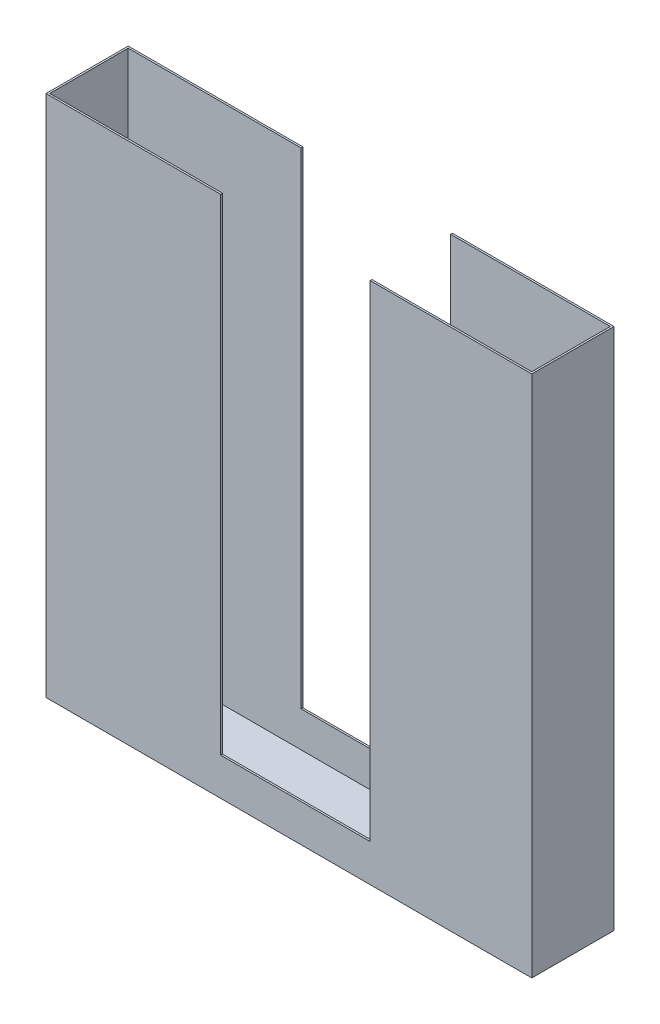
ISO-10303-21;
HEADER;
FILE_DESCRIPTION(('STEP AP214'),'2;1');
FILE_NAME('part.step','',(''),(''),'','','');
FILE_SCHEMA(('AUTOMOTIVE_DESIGN { 1 0 10303 214 1 1 1 1 }'));
ENDSEC;
DATA;
#1=APPLICATION_CONTEXT('core data for automotive mechanical design processes');
#2=APPLICATION_PROTOCOL_DEFINITION('international standard','automotive_design',2000,#1);
#3=PRODUCT_CONTEXT('',#1,'mechanical');
#4=PRODUCT('Part','Part','',(#3));
#5=PRODUCT_RELATED_PRODUCT_CATEGORY('part','',(#4));
#6=PRODUCT_DEFINITION_FORMATION('','',#4);
#7=PRODUCT_DEFINITION_CONTEXT('part definition',#1,'design');
#8=PRODUCT_DEFINITION('design','',#6,#7);
#9=PRODUCT_DEFINITION_SHAPE('','',#8);
#10=(LENGTH_UNIT() NAMED_UNIT(*) SI_UNIT(.MILLI.,.METRE.));
#11=(NAMED_UNIT(*) PLANE_ANGLE_UNIT() SI_UNIT($,.RADIAN.));
#12=(NAMED_UNIT(*) SI_UNIT($,.STERADIAN.) SOLID_ANGLE_UNIT());
#13=UNCERTAINTY_MEASURE_WITH_UNIT(LENGTH_MEASURE(1.E-05),#10,'distance_accuracy_value','');
#14=(GEOMETRIC_REPRESENTATION_CONTEXT(3) GLOBAL_UNCERTAINTY_ASSIGNED_CONTEXT((#13)) GLOBAL_UNIT_ASSIGNED_CONTEXT((#10,
#11,#12)) REPRESENTATION_CONTEXT('',''));
#15=CARTESIAN_POINT('',(0.,0.,0.));
#16=DIRECTION('',(0.,0.,1.));
#17=DIRECTION('',(1.,0.,0.));
#18=AXIS2_PLACEMENT_3D('',#15,#16,#17);
#19=CARTESIAN_POINT('',(-118.55585106383,36.2253989361702,69.85));
#20=DIRECTION('',(0.,1.,0.));
#21=DIRECTION('',(0.,0.,1.));
#22=AXIS2_PLACEMENT_3D('',#19,#20,#21);
#23=PLANE('',#22);
#24=DIRECTION('',(0.,0.,1.));
#25=VECTOR('',#24,1.);
#26=CARTESIAN_POINT('',(29.9023693860386,36.2253989361702,69.85));
#27=LINE('',#26,#25);
#28=CARTESIAN_POINT('',(29.9023693860386,36.2253989361702,0.));
#29=VERTEX_POINT('',#28);
#30=CARTESIAN_POINT('',(29.9023693860386,36.2253989361702,1.5875));
#31=VERTEX_POINT('',#30);
#32=EDGE_CURVE('E185',#29,#31,#27,.T.);
#33=ORIENTED_EDGE('',*,*,#32,.F.);
#34=DIRECTION('',(1.,0.,0.));
#35=VECTOR('',#34,1.);
#36=CARTESIAN_POINT('',(-118.55585106383,36.2253989361702,0.));
#37=LINE('',#36,#35);
#38=CARTESIAN_POINT('',(-118.55585106383,36.2253989361702,0.));
#39=VERTEX_POINT('',#38);
#40=EDGE_CURVE('E165',#39,#29,#37,.T.);
#41=ORIENTED_EDGE('',*,*,#40,.F.);
#42=DIRECTION('',(0.,0.,-1.));
#43=VECTOR('',#42,1.);
#44=CARTESIAN_POINT('',(-118.55585106383,36.2253989361702,69.85));
#45=LINE('',#44,#43);
#46=CARTESIAN_POINT('',(-118.55585106383,36.2253989361702,69.85));
#47=VERTEX_POINT('',#46);
#48=EDGE_CURVE('E240',#47,#39,#45,.T.);
#49=ORIENTED_EDGE('',*,*,#48,.F.);
#50=DIRECTION('',(1.,0.,0.));
#51=VECTOR('',#50,1.);
#52=CARTESIAN_POINT('',(-118.55585106383,36.2253989361702,69.85));
#53=LINE('',#52,#51);
#54=CARTESIAN_POINT('',(29.9023693860386,36.2253989361702,69.85));
#55=VERTEX_POINT('',#54);
#56=EDGE_CURVE('E237',#47,#55,#53,.T.);
#57=ORIENTED_EDGE('',*,*,#56,.T.);
#58=CARTESIAN_POINT('',(29.9023693860386,36.2253989361702,68.2625));
#59=VERTEX_POINT('',#58);
#60=EDGE_CURVE('E188',#59,#55,#27,.T.);
#61=ORIENTED_EDGE('',*,*,#60,.F.);
#62=DIRECTION('',(1.,0.,0.));
#63=VECTOR('',#62,1.);
#64=CARTESIAN_POINT('',(-118.55585106383,36.2253989361702,68.2625));
#65=LINE('',#64,#63);
#66=CARTESIAN_POINT('',(-116.96835106383,36.2253989361702,68.2625));
#67=VERTEX_POINT('',#66);
#68=EDGE_CURVE('E221',#67,#59,#65,.T.);
#69=ORIENTED_EDGE('',*,*,#68,.F.);
#70=DIRECTION('',(0.,0.,-1.));
#71=VECTOR('',#70,1.);
#72=CARTESIAN_POINT('',(-116.96835106383,36.2253989361702,69.85));
#73=LINE('',#72,#71);
#74=CARTESIAN_POINT('',(-116.96835106383,36.2253989361702,1.5875));
#75=VERTEX_POINT('',#74);
#76=EDGE_CURVE('E218',#67,#75,#73,.T.);
#77=ORIENTED_EDGE('',*,*,#76,.T.);
#78=DIRECTION('',(1.,0.,0.));
#79=VECTOR('',#78,1.);
#80=CARTESIAN_POINT('',(-118.55585106383,36.2253989361702,1.58750000000001));
#81=LINE('',#80,#79);
#82=EDGE_CURVE('E204',#75,#31,#81,.T.);
#83=ORIENTED_EDGE('',*,*,#82,.T.);
#84=EDGE_LOOP('',(#33,#41,#49,#57,#61,#69,#77,#83));
#85=FACE_BOUND('',#84,.T.);
#86=ADVANCED_FACE('F33',(#85),#23,.T.);
#87=DIRECTION('',(0.,0.,-1.));
#88=VECTOR('',#87,1.);
#89=CARTESIAN_POINT('',(156.902369386039,36.2253989361702,69.85));
#90=LINE('',#89,#88);
#91=CARTESIAN_POINT('',(156.902369386039,36.2253989361702,69.85));
#92=VERTEX_POINT('',#91);
#93=CARTESIAN_POINT('',(156.902369386039,36.2253989361702,68.2625));
#94=VERTEX_POINT('',#93);
#95=EDGE_CURVE('E182',#92,#94,#90,.T.);
#96=ORIENTED_EDGE('',*,*,#95,.F.);
#97=CARTESIAN_POINT('',(294.19414893617,36.2253989361702,69.85));
#98=VERTEX_POINT('',#97);
#99=EDGE_CURVE('E236',#92,#98,#53,.T.);
#100=ORIENTED_EDGE('',*,*,#99,.T.);
#101=DIRECTION('',(0.,0.,-1.));
#102=VECTOR('',#101,1.);
#103=CARTESIAN_POINT('',(294.19414893617,36.2253989361702,69.85));
#104=LINE('',#103,#102);
#105=CARTESIAN_POINT('',(294.19414893617,36.2253989361702,0.));
#106=VERTEX_POINT('',#105);
#107=EDGE_CURVE('E252',#98,#106,#104,.T.);
#108=ORIENTED_EDGE('',*,*,#107,.T.);
#109=CARTESIAN_POINT('',(156.902369386039,36.2253989361702,0.));
#110=VERTEX_POINT('',#109);
#111=EDGE_CURVE('E249',#110,#106,#37,.T.);
#112=ORIENTED_EDGE('',*,*,#111,.F.);
#113=CARTESIAN_POINT('',(156.902369386039,36.2253989361702,1.5875));
#114=VERTEX_POINT('',#113);
#115=EDGE_CURVE('E179',#114,#110,#90,.T.);
#116=ORIENTED_EDGE('',*,*,#115,.F.);
#117=CARTESIAN_POINT('',(292.60664893617,36.2253989361702,1.5875));
#118=VERTEX_POINT('',#117);
#119=EDGE_CURVE('E214',#114,#118,#81,.T.);
#120=ORIENTED_EDGE('',*,*,#119,.T.);
#121=DIRECTION('',(0.,0.,-1.));
#122=VECTOR('',#121,1.);
#123=CARTESIAN_POINT('',(292.60664893617,36.2253989361702,69.85));
#124=LINE('',#123,#122);
#125=CARTESIAN_POINT('',(292.60664893617,36.2253989361702,68.2625));
#126=VERTEX_POINT('',#125);
#127=EDGE_CURVE('E209',#126,#118,#124,.T.);
#128=ORIENTED_EDGE('',*,*,#127,.F.);
#129=EDGE_CURVE('E217',#94,#126,#65,.T.);
#130=ORIENTED_EDGE('',*,*,#129,.F.);
#131=EDGE_LOOP('',(#96,#100,#108,#112,#116,#120,#128,#130));
#132=FACE_BOUND('',#131,.T.);
#133=ADVANCED_FACE('F270',(#132),#23,.T.);
#134=CARTESIAN_POINT('',(-118.55585106383,36.2253989361702,69.85));
#135=DIRECTION('',(1.,0.,0.));
#136=DIRECTION('',(0.,1.,0.));
#137=AXIS2_PLACEMENT_3D('',#134,#135,#136);
#138=PLANE('',#137);
#139=DIRECTION('',(0.,-1.,0.));
#140=VECTOR('',#139,1.);
#141=CARTESIAN_POINT('',(-118.55585106383,36.2253989361702,0.));
#142=LINE('',#141,#140);
#143=CARTESIAN_POINT('',(-118.55585106383,-408.27460106383,0.));
#144=VERTEX_POINT('',#143);
#145=EDGE_CURVE('E198',#39,#144,#142,.T.);
#146=ORIENTED_EDGE('',*,*,#145,.T.);
#147=DIRECTION('',(0.,0.,-1.));
#148=VECTOR('',#147,1.);
#149=CARTESIAN_POINT('',(-118.55585106383,-408.27460106383,69.85));
#150=LINE('',#149,#148);
#151=CARTESIAN_POINT('',(-118.55585106383,-408.27460106383,69.85));
#152=VERTEX_POINT('',#151);
#153=EDGE_CURVE('E257',#152,#144,#150,.T.);
#154=ORIENTED_EDGE('',*,*,#153,.F.);
#155=DIRECTION('',(0.,-1.,0.));
#156=VECTOR('',#155,1.);
#157=CARTESIAN_POINT('',(-118.55585106383,36.2253989361702,69.85));
#158=LINE('',#157,#156);
#159=EDGE_CURVE('E228',#47,#152,#158,.T.);
#160=ORIENTED_EDGE('',*,*,#159,.F.);
#161=ORIENTED_EDGE('',*,*,#48,.T.);
#162=EDGE_LOOP('',(#146,#154,#160,#161));
#163=FACE_BOUND('',#162,.T.);
#164=ADVANCED_FACE('F35',(#163),#138,.F.);
#165=CARTESIAN_POINT('',(-118.55585106383,-408.27460106383,69.85));
#166=DIRECTION('',(0.,1.,0.));
#167=DIRECTION('',(0.,0.,1.));
#168=AXIS2_PLACEMENT_3D('',#165,#166,#167);
#169=PLANE('',#168);
#170=DIRECTION('',(1.,0.,0.));
#171=VECTOR('',#170,1.);
#172=CARTESIAN_POINT('',(-118.55585106383,-408.27460106383,0.));
#173=LINE('',#172,#171);
#174=CARTESIAN_POINT('',(294.19414893617,-408.27460106383,0.));
#175=VERTEX_POINT('',#174);
#176=EDGE_CURVE('E243',#144,#175,#173,.T.);
#177=ORIENTED_EDGE('',*,*,#176,.T.);
#178=DIRECTION('',(0.,0.,-1.));
#179=VECTOR('',#178,1.);
#180=CARTESIAN_POINT('',(294.19414893617,-408.27460106383,69.85));
#181=LINE('',#180,#179);
#182=CARTESIAN_POINT('',(294.19414893617,-408.27460106383,69.85));
#183=VERTEX_POINT('',#182);
#184=EDGE_CURVE('E255',#183,#175,#181,.T.);
#185=ORIENTED_EDGE('',*,*,#184,.F.);
#186=DIRECTION('',(1.,0.,0.));
#187=VECTOR('',#186,1.);
#188=CARTESIAN_POINT('',(-118.55585106383,-408.27460106383,69.85));
#189=LINE('',#188,#187);
#190=EDGE_CURVE('E231',#152,#183,#189,.T.);
#191=ORIENTED_EDGE('',*,*,#190,.F.);
#192=ORIENTED_EDGE('',*,*,#153,.T.);
#193=EDGE_LOOP('',(#177,#185,#191,#192));
#194=FACE_BOUND('',#193,.T.);
#195=ADVANCED_FACE('F297',(#194),#169,.F.);
#196=CARTESIAN_POINT('',(294.19414893617,36.2253989361702,69.85));
#197=DIRECTION('',(1.,0.,0.));
#198=DIRECTION('',(0.,1.,0.));
#199=AXIS2_PLACEMENT_3D('',#196,#197,#198);
#200=PLANE('',#199);
#201=DIRECTION('',(0.,-1.,0.));
#202=VECTOR('',#201,1.);
#203=CARTESIAN_POINT('',(294.19414893617,36.2253989361702,0.));
#204=LINE('',#203,#202);
#205=EDGE_CURVE('E246',#106,#175,#204,.T.);
#206=ORIENTED_EDGE('',*,*,#205,.F.);
#207=ORIENTED_EDGE('',*,*,#107,.F.);
#208=DIRECTION('',(0.,-1.,0.));
#209=VECTOR('',#208,1.);
#210=CARTESIAN_POINT('',(294.19414893617,36.2253989361702,69.85));
#211=LINE('',#210,#209);
#212=EDGE_CURVE('E233',#98,#183,#211,.T.);
#213=ORIENTED_EDGE('',*,*,#212,.T.);
#214=ORIENTED_EDGE('',*,*,#184,.T.);
#215=EDGE_LOOP('',(#206,#207,#213,#214));
#216=FACE_BOUND('',#215,.T.);
#217=ADVANCED_FACE('F293',(#216),#200,.T.);
#218=CARTESIAN_POINT('',(0.,0.,69.85));
#219=DIRECTION('',(0.,0.,1.));
#220=DIRECTION('',(1.,0.,0.));
#221=AXIS2_PLACEMENT_3D('',#218,#219,#220);
#222=PLANE('',#221);
#223=DIRECTION('',(0.,-1.,0.));
#224=VECTOR('',#223,1.);
#225=CARTESIAN_POINT('',(29.9023693860386,36.2498882057866,69.85));
#226=LINE('',#225,#224);
#227=CARTESIAN_POINT('',(29.9023693860387,-376.500111794213,69.85));
#228=VERTEX_POINT('',#227);
#229=EDGE_CURVE('E172',#55,#228,#226,.T.);
#230=ORIENTED_EDGE('',*,*,#229,.F.);
#231=ORIENTED_EDGE('',*,*,#56,.F.);
#232=ORIENTED_EDGE('',*,*,#159,.T.);
#233=ORIENTED_EDGE('',*,*,#190,.T.);
#234=ORIENTED_EDGE('',*,*,#212,.F.);
#235=ORIENTED_EDGE('',*,*,#99,.F.);
#236=DIRECTION('',(0.,1.,0.));
#237=VECTOR('',#236,1.);
#238=CARTESIAN_POINT('',(156.902369386039,36.2498882057866,69.85));
#239=LINE('',#238,#237);
#240=CARTESIAN_POINT('',(156.902369386039,-376.500111794213,69.85));
#241=VERTEX_POINT('',#240);
#242=EDGE_CURVE('E166',#241,#92,#239,.T.);
#243=ORIENTED_EDGE('',*,*,#242,.F.);
#244=DIRECTION('',(1.,0.,0.));
#245=VECTOR('',#244,1.);
#246=CARTESIAN_POINT('',(29.9023693860387,-376.500111794213,69.85));
#247=LINE('',#246,#245);
#248=EDGE_CURVE('E168',#228,#241,#247,.T.);
#249=ORIENTED_EDGE('',*,*,#248,.F.);
#250=EDGE_LOOP('',(#230,#231,#232,#233,#234,#235,#243,#249));
#251=FACE_BOUND('',#250,.T.);
#252=ADVANCED_FACE('F288',(#251),#222,.T.);
#253=CARTESIAN_POINT('',(0.,0.,0.));
#254=DIRECTION('',(0.,0.,1.));
#255=DIRECTION('',(1.,0.,0.));
#256=AXIS2_PLACEMENT_3D('',#253,#254,#255);
#257=PLANE('',#256);
#258=ORIENTED_EDGE('',*,*,#40,.T.);
#259=DIRECTION('',(0.,-1.,0.));
#260=VECTOR('',#259,1.);
#261=CARTESIAN_POINT('',(29.9023693860386,36.2498882057866,0.));
#262=LINE('',#261,#260);
#263=CARTESIAN_POINT('',(29.9023693860387,-376.500111794213,0.));
#264=VERTEX_POINT('',#263);
#265=EDGE_CURVE('E145',#29,#264,#262,.T.);
#266=ORIENTED_EDGE('',*,*,#265,.T.);
#267=DIRECTION('',(1.,0.,0.));
#268=VECTOR('',#267,1.);
#269=CARTESIAN_POINT('',(29.9023693860387,-376.500111794213,0.));
#270=LINE('',#269,#268);
#271=CARTESIAN_POINT('',(156.902369386039,-376.500111794213,0.));
#272=VERTEX_POINT('',#271);
#273=EDGE_CURVE('E152',#264,#272,#270,.T.);
#274=ORIENTED_EDGE('',*,*,#273,.T.);
#275=DIRECTION('',(0.,1.,0.));
#276=VECTOR('',#275,1.);
#277=CARTESIAN_POINT('',(156.902369386039,36.2498882057866,0.));
#278=LINE('',#277,#276);
#279=EDGE_CURVE('E159',#272,#110,#278,.T.);
#280=ORIENTED_EDGE('',*,*,#279,.T.);
#281=ORIENTED_EDGE('',*,*,#111,.T.);
#282=ORIENTED_EDGE('',*,*,#205,.T.);
#283=ORIENTED_EDGE('',*,*,#176,.F.);
#284=ORIENTED_EDGE('',*,*,#145,.F.);
#285=EDGE_LOOP('',(#258,#266,#274,#280,#281,#282,#283,#284));
#286=FACE_BOUND('',#285,.T.);
#287=ADVANCED_FACE('F162',(#286),#257,.F.);
#288=CARTESIAN_POINT('',(-116.96835106383,36.2253989361702,69.85));
#289=DIRECTION('',(1.,0.,0.));
#290=DIRECTION('',(0.,1.,0.));
#291=AXIS2_PLACEMENT_3D('',#288,#289,#290);
#292=PLANE('',#291);
#293=DIRECTION('',(0.,-1.,0.));
#294=VECTOR('',#293,1.);
#295=CARTESIAN_POINT('',(-116.96835106383,36.2253989361702,1.58750000000001));
#296=LINE('',#295,#294);
#297=CARTESIAN_POINT('',(-116.96835106383,-406.68710106383,1.5875));
#298=VERTEX_POINT('',#297);
#299=EDGE_CURVE('E191',#75,#298,#296,.T.);
#300=ORIENTED_EDGE('',*,*,#299,.F.);
#301=ORIENTED_EDGE('',*,*,#76,.F.);
#302=DIRECTION('',(0.,-1.,0.));
#303=VECTOR('',#302,1.);
#304=CARTESIAN_POINT('',(-116.96835106383,36.2253989361702,68.2625));
#305=LINE('',#304,#303);
#306=CARTESIAN_POINT('',(-116.96835106383,-406.68710106383,68.2625));
#307=VERTEX_POINT('',#306);
#308=EDGE_CURVE('E200',#67,#307,#305,.T.);
#309=ORIENTED_EDGE('',*,*,#308,.T.);
#310=DIRECTION('',(0.,0.,-1.));
#311=VECTOR('',#310,1.);
#312=CARTESIAN_POINT('',(-116.96835106383,-406.68710106383,69.85));
#313=LINE('',#312,#311);
#314=EDGE_CURVE('E195',#307,#298,#313,.T.);
#315=ORIENTED_EDGE('',*,*,#314,.T.);
#316=EDGE_LOOP('',(#300,#301,#309,#315));
#317=FACE_BOUND('',#316,.T.);
#318=ADVANCED_FACE('F307',(#317),#292,.T.);
#319=CARTESIAN_POINT('',(-118.55585106383,-406.68710106383,69.85));
#320=DIRECTION('',(0.,1.,0.));
#321=DIRECTION('',(0.,0.,1.));
#322=AXIS2_PLACEMENT_3D('',#319,#320,#321);
#323=PLANE('',#322);
#324=DIRECTION('',(1.,0.,0.));
#325=VECTOR('',#324,1.);
#326=CARTESIAN_POINT('',(-118.55585106383,-406.68710106383,1.58750000000001));
#327=LINE('',#326,#325);
#328=CARTESIAN_POINT('',(292.60664893617,-406.68710106383,1.5875));
#329=VERTEX_POINT('',#328);
#330=EDGE_CURVE('E194',#298,#329,#327,.T.);
#331=ORIENTED_EDGE('',*,*,#330,.F.);
#332=ORIENTED_EDGE('',*,*,#314,.F.);
#333=DIRECTION('',(1.,0.,0.));
#334=VECTOR('',#333,1.);
#335=CARTESIAN_POINT('',(-118.55585106383,-406.68710106383,68.2625));
#336=LINE('',#335,#334);
#337=CARTESIAN_POINT('',(292.60664893617,-406.68710106383,68.2625));
#338=VERTEX_POINT('',#337);
#339=EDGE_CURVE('E203',#307,#338,#336,.T.);
#340=ORIENTED_EDGE('',*,*,#339,.T.);
#341=DIRECTION('',(0.,0.,-1.));
#342=VECTOR('',#341,1.);
#343=CARTESIAN_POINT('',(292.60664893617,-406.68710106383,69.85));
#344=LINE('',#343,#342);
#345=EDGE_CURVE('E199',#338,#329,#344,.T.);
#346=ORIENTED_EDGE('',*,*,#345,.T.);
#347=EDGE_LOOP('',(#331,#332,#340,#346));
#348=FACE_BOUND('',#347,.T.);
#349=ADVANCED_FACE('F310',(#348),#323,.T.);
#350=CARTESIAN_POINT('',(292.60664893617,36.2253989361702,69.85));
#351=DIRECTION('',(1.,0.,0.));
#352=DIRECTION('',(0.,1.,0.));
#353=AXIS2_PLACEMENT_3D('',#350,#351,#352);
#354=PLANE('',#353);
#355=DIRECTION('',(0.,-1.,0.));
#356=VECTOR('',#355,1.);
#357=CARTESIAN_POINT('',(292.60664893617,36.2253989361702,1.58750000000001));
#358=LINE('',#357,#356);
#359=EDGE_CURVE('E207',#118,#329,#358,.T.);
#360=ORIENTED_EDGE('',*,*,#359,.T.);
#361=ORIENTED_EDGE('',*,*,#345,.F.);
#362=DIRECTION('',(0.,-1.,0.));
#363=VECTOR('',#362,1.);
#364=CARTESIAN_POINT('',(292.60664893617,36.2253989361702,68.2625));
#365=LINE('',#364,#363);
#366=EDGE_CURVE('E211',#126,#338,#365,.T.);
#367=ORIENTED_EDGE('',*,*,#366,.F.);
#368=ORIENTED_EDGE('',*,*,#127,.T.);
#369=EDGE_LOOP('',(#360,#361,#367,#368));
#370=FACE_BOUND('',#369,.T.);
#371=ADVANCED_FACE('F276',(#370),#354,.F.);
#372=CARTESIAN_POINT('',(0.,0.,68.2625));
#373=DIRECTION('',(0.,0.,1.));
#374=DIRECTION('',(1.,0.,0.));
#375=AXIS2_PLACEMENT_3D('',#372,#373,#374);
#376=PLANE('',#375);
#377=ORIENTED_EDGE('',*,*,#68,.T.);
#378=DIRECTION('',(0.,-1.,0.));
#379=VECTOR('',#378,1.);
#380=CARTESIAN_POINT('',(29.9023693860386,0.,68.2625));
#381=LINE('',#380,#379);
#382=CARTESIAN_POINT('',(29.9023693860387,-376.500111794213,68.2625));
#383=VERTEX_POINT('',#382);
#384=EDGE_CURVE('E187',#59,#383,#381,.T.);
#385=ORIENTED_EDGE('',*,*,#384,.T.);
#386=DIRECTION('',(1.,0.,0.));
#387=VECTOR('',#386,1.);
#388=CARTESIAN_POINT('',(-1.64566572003103E-13,-376.500111794213,68.2625));
#389=LINE('',#388,#387);
#390=CARTESIAN_POINT('',(156.902369386039,-376.500111794213,68.2625));
#391=VERTEX_POINT('',#390);
#392=EDGE_CURVE('E175',#383,#391,#389,.T.);
#393=ORIENTED_EDGE('',*,*,#392,.T.);
#394=DIRECTION('',(0.,1.,0.));
#395=VECTOR('',#394,1.);
#396=CARTESIAN_POINT('',(156.902369386039,0.,68.2625));
#397=LINE('',#396,#395);
#398=EDGE_CURVE('E181',#391,#94,#397,.T.);
#399=ORIENTED_EDGE('',*,*,#398,.T.);
#400=ORIENTED_EDGE('',*,*,#129,.T.);
#401=ORIENTED_EDGE('',*,*,#366,.T.);
#402=ORIENTED_EDGE('',*,*,#339,.F.);
#403=ORIENTED_EDGE('',*,*,#308,.F.);
#404=EDGE_LOOP('',(#377,#385,#393,#399,#400,#401,#402,#403));
#405=FACE_BOUND('',#404,.T.);
#406=ADVANCED_FACE('F281',(#405),#376,.F.);
#407=CARTESIAN_POINT('',(0.,0.,1.5875));
#408=DIRECTION('',(0.,0.,1.));
#409=DIRECTION('',(1.,0.,0.));
#410=AXIS2_PLACEMENT_3D('',#407,#408,#409);
#411=PLANE('',#410);
#412=DIRECTION('',(0.,-1.,0.));
#413=VECTOR('',#412,1.);
#414=CARTESIAN_POINT('',(29.9023693860386,0.,1.5875));
#415=LINE('',#414,#413);
#416=CARTESIAN_POINT('',(29.9023693860387,-376.500111794213,1.5875));
#417=VERTEX_POINT('',#416);
#418=EDGE_CURVE('E11',#31,#417,#415,.T.);
#419=ORIENTED_EDGE('',*,*,#418,.F.);
#420=ORIENTED_EDGE('',*,*,#82,.F.);
#421=ORIENTED_EDGE('',*,*,#299,.T.);
#422=ORIENTED_EDGE('',*,*,#330,.T.);
#423=ORIENTED_EDGE('',*,*,#359,.F.);
#424=ORIENTED_EDGE('',*,*,#119,.F.);
#425=DIRECTION('',(0.,1.,0.));
#426=VECTOR('',#425,1.);
#427=CARTESIAN_POINT('',(156.902369386039,0.,1.5875));
#428=LINE('',#427,#426);
#429=CARTESIAN_POINT('',(156.902369386039,-376.500111794213,1.5875));
#430=VERTEX_POINT('',#429);
#431=EDGE_CURVE('E41',#430,#114,#428,.T.);
#432=ORIENTED_EDGE('',*,*,#431,.F.);
#433=DIRECTION('',(1.,0.,0.));
#434=VECTOR('',#433,1.);
#435=CARTESIAN_POINT('',(-1.64566572003103E-13,-376.500111794213,1.5875));
#436=LINE('',#435,#434);
#437=EDGE_CURVE('E260',#417,#430,#436,.T.);
#438=ORIENTED_EDGE('',*,*,#437,.F.);
#439=EDGE_LOOP('',(#419,#420,#421,#422,#423,#424,#432,#438));
#440=FACE_BOUND('',#439,.T.);
#441=ADVANCED_FACE('F273',(#440),#411,.T.);
#442=CARTESIAN_POINT('',(29.9023693860387,-376.500111794213,0.));
#443=DIRECTION('',(0.,-1.,0.));
#444=DIRECTION('',(1.,0.,0.));
#445=AXIS2_PLACEMENT_3D('',#442,#443,#444);
#446=PLANE('',#445);
#447=ORIENTED_EDGE('',*,*,#437,.T.);
#448=DIRECTION('',(0.,0.,1.));
#449=VECTOR('',#448,1.);
#450=CARTESIAN_POINT('',(156.902369386039,-376.500111794213,0.));
#451=LINE('',#450,#449);
#452=EDGE_CURVE('E155',#272,#430,#451,.T.);
#453=ORIENTED_EDGE('',*,*,#452,.F.);
#454=ORIENTED_EDGE('',*,*,#273,.F.);
#455=DIRECTION('',(0.,0.,1.));
#456=VECTOR('',#455,1.);
#457=CARTESIAN_POINT('',(29.9023693860387,-376.500111794213,0.));
#458=LINE('',#457,#456);
#459=EDGE_CURVE('E56',#264,#417,#458,.T.);
#460=ORIENTED_EDGE('',*,*,#459,.T.);
#461=EDGE_LOOP('',(#447,#453,#454,#460));
#462=FACE_BOUND('',#461,.T.);
#463=ADVANCED_FACE('F153',(#462),#446,.F.);
#464=CARTESIAN_POINT('',(156.902369386039,36.2498882057866,0.));
#465=DIRECTION('',(1.,0.,0.));
#466=DIRECTION('',(0.,0.,-1.));
#467=AXIS2_PLACEMENT_3D('',#464,#465,#466);
#468=PLANE('',#467);
#469=ORIENTED_EDGE('',*,*,#115,.T.);
#470=ORIENTED_EDGE('',*,*,#279,.F.);
#471=ORIENTED_EDGE('',*,*,#452,.T.);
#472=ORIENTED_EDGE('',*,*,#431,.T.);
#473=EDGE_LOOP('',(#469,#470,#471,#472));
#474=FACE_BOUND('',#473,.T.);
#475=ADVANCED_FACE('F264',(#474),#468,.F.);
#476=CARTESIAN_POINT('',(29.9023693860386,36.2498882057866,0.));
#477=DIRECTION('',(-1.,0.,0.));
#478=DIRECTION('',(0.,-1.,0.));
#479=AXIS2_PLACEMENT_3D('',#476,#477,#478);
#480=PLANE('',#479);
#481=ORIENTED_EDGE('',*,*,#32,.T.);
#482=ORIENTED_EDGE('',*,*,#418,.T.);
#483=ORIENTED_EDGE('',*,*,#459,.F.);
#484=ORIENTED_EDGE('',*,*,#265,.F.);
#485=EDGE_LOOP('',(#481,#482,#483,#484));
#486=FACE_BOUND('',#485,.T.);
#487=ADVANCED_FACE('F143',(#486),#480,.F.);
#488=ORIENTED_EDGE('',*,*,#60,.T.);
#489=ORIENTED_EDGE('',*,*,#229,.T.);
#490=EDGE_CURVE('E149',#383,#228,#458,.T.);
#491=ORIENTED_EDGE('',*,*,#490,.F.);
#492=ORIENTED_EDGE('',*,*,#384,.F.);
#493=EDGE_LOOP('',(#488,#489,#491,#492));
#494=FACE_BOUND('',#493,.T.);
#495=ADVANCED_FACE('F400',(#494),#480,.F.);
#496=ORIENTED_EDGE('',*,*,#95,.T.);
#497=ORIENTED_EDGE('',*,*,#398,.F.);
#498=EDGE_CURVE('E48',#391,#241,#451,.T.);
#499=ORIENTED_EDGE('',*,*,#498,.T.);
#500=ORIENTED_EDGE('',*,*,#242,.T.);
#501=EDGE_LOOP('',(#496,#497,#499,#500));
#502=FACE_BOUND('',#501,.T.);
#503=ADVANCED_FACE('F283',(#502),#468,.F.);
#504=ORIENTED_EDGE('',*,*,#490,.T.);
#505=ORIENTED_EDGE('',*,*,#248,.T.);
#506=ORIENTED_EDGE('',*,*,#498,.F.);
#507=ORIENTED_EDGE('',*,*,#392,.F.);
#508=EDGE_LOOP('',(#504,#505,#506,#507));
#509=FACE_BOUND('',#508,.T.);
#510=ADVANCED_FACE('F384',(#509),#446,.F.);
#511=CLOSED_SHELL('',(#86,#133,#164,#195,#217,#252,#287,#318,#349,#371,#406,#441,#463,#475,#487,
#495,#503,#510));
#512=MANIFOLD_SOLID_BREP('B2',#511);
#513=ADVANCED_BREP_SHAPE_REPRESENTATION('',(#18,#512),#14);
#514=SHAPE_DEFINITION_REPRESENTATION(#9,#513);
ENDSEC;
END-ISO-10303-21;
